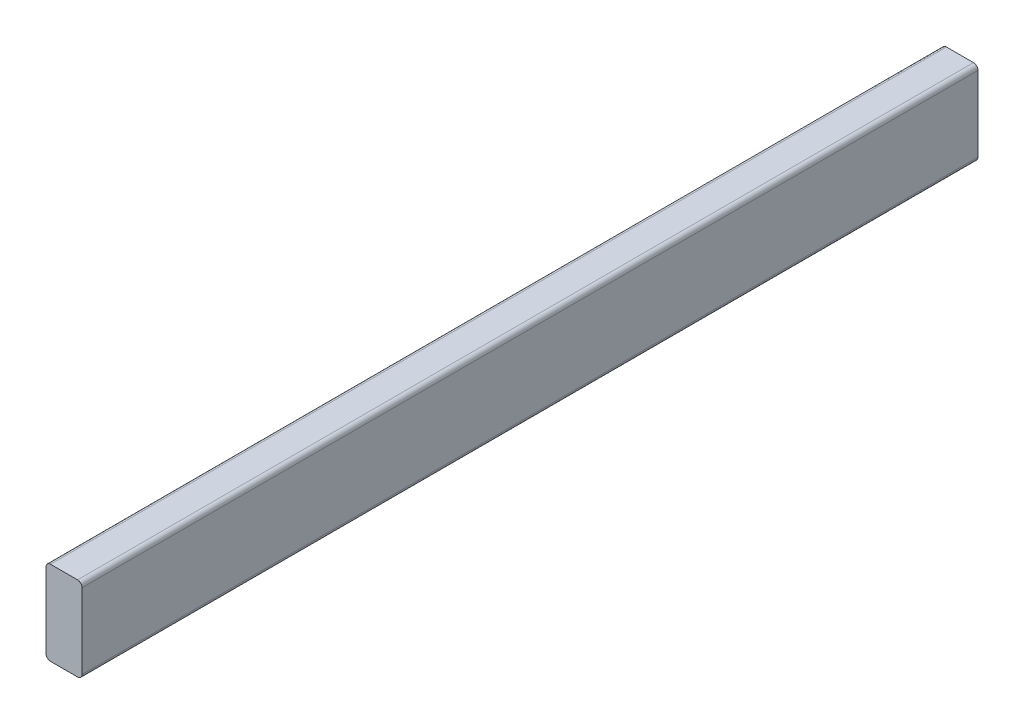
ISO-10303-21;
HEADER;
FILE_DESCRIPTION(('STEP AP214'),'2;1');
FILE_NAME('part.step','',(''),(''),'','','');
FILE_SCHEMA(('AUTOMOTIVE_DESIGN { 1 0 10303 214 1 1 1 1 }'));
ENDSEC;
DATA;
#1=APPLICATION_CONTEXT('core data for automotive mechanical design processes');
#2=APPLICATION_PROTOCOL_DEFINITION('international standard','automotive_design',2000,#1);
#3=PRODUCT_CONTEXT('',#1,'mechanical');
#4=PRODUCT('Part','Part','',(#3));
#5=PRODUCT_RELATED_PRODUCT_CATEGORY('part','',(#4));
#6=PRODUCT_DEFINITION_FORMATION('','',#4);
#7=PRODUCT_DEFINITION_CONTEXT('part definition',#1,'design');
#8=PRODUCT_DEFINITION('design','',#6,#7);
#9=PRODUCT_DEFINITION_SHAPE('','',#8);
#10=(LENGTH_UNIT() NAMED_UNIT(*) SI_UNIT(.MILLI.,.METRE.));
#11=(NAMED_UNIT(*) PLANE_ANGLE_UNIT() SI_UNIT($,.RADIAN.));
#12=(NAMED_UNIT(*) SI_UNIT($,.STERADIAN.) SOLID_ANGLE_UNIT());
#13=UNCERTAINTY_MEASURE_WITH_UNIT(LENGTH_MEASURE(1.E-05),#10,'distance_accuracy_value','');
#14=(GEOMETRIC_REPRESENTATION_CONTEXT(3) GLOBAL_UNCERTAINTY_ASSIGNED_CONTEXT((#13)) GLOBAL_UNIT_ASSIGNED_CONTEXT((#10,
#11,#12)) REPRESENTATION_CONTEXT('',''));
#15=CARTESIAN_POINT('',(0.,0.,0.));
#16=DIRECTION('',(0.,0.,1.));
#17=DIRECTION('',(1.,0.,0.));
#18=AXIS2_PLACEMENT_3D('',#15,#16,#17);
#19=CARTESIAN_POINT('',(0.,0.,0.));
#20=DIRECTION('',(0.,0.,-1.));
#21=DIRECTION('',(-1.,0.,0.));
#22=AXIS2_PLACEMENT_3D('',#19,#20,#21);
#23=PLANE('',#22);
#24=DIRECTION('',(0.,-1.,0.));
#25=VECTOR('',#24,1.);
#26=CARTESIAN_POINT('',(-819.830594651,88.9,0.));
#27=LINE('',#26,#25);
#28=CARTESIAN_POINT('',(-819.830594651,84.1375,0.));
#29=VERTEX_POINT('',#28);
#30=CARTESIAN_POINT('',(-819.830594651,4.7625,0.));
#31=VERTEX_POINT('',#30);
#32=EDGE_CURVE('E112',#29,#31,#27,.T.);
#33=ORIENTED_EDGE('',*,*,#32,.T.);
#34=CARTESIAN_POINT('',(-815.068094651,4.7625,0.));
#35=DIRECTION('',(0.,0.,-1.));
#36=DIRECTION('',(-1.,0.,0.));
#37=AXIS2_PLACEMENT_3D('',#34,#35,#36);
#38=CIRCLE('',#37,4.7625);
#39=CARTESIAN_POINT('',(-815.068094651,0.,0.));
#40=VERTEX_POINT('',#39);
#41=EDGE_CURVE('E189',#31,#40,#38,.F.);
#42=ORIENTED_EDGE('',*,*,#41,.T.);
#43=DIRECTION('',(1.,0.,0.));
#44=VECTOR('',#43,1.);
#45=CARTESIAN_POINT('',(-781.730594651,0.,0.));
#46=LINE('',#45,#44);
#47=CARTESIAN_POINT('',(-786.493094651,0.,0.));
#48=VERTEX_POINT('',#47);
#49=EDGE_CURVE('E117',#40,#48,#46,.T.);
#50=ORIENTED_EDGE('',*,*,#49,.T.);
#51=CARTESIAN_POINT('',(-786.493094651,4.7625,0.));
#52=DIRECTION('',(0.,0.,-1.));
#53=DIRECTION('',(-1.,0.,0.));
#54=AXIS2_PLACEMENT_3D('',#51,#52,#53);
#55=CIRCLE('',#54,4.7625);
#56=CARTESIAN_POINT('',(-781.730594651,4.7625,0.));
#57=VERTEX_POINT('',#56);
#58=EDGE_CURVE('E168',#48,#57,#55,.F.);
#59=ORIENTED_EDGE('',*,*,#58,.T.);
#60=DIRECTION('',(0.,1.,0.));
#61=VECTOR('',#60,1.);
#62=CARTESIAN_POINT('',(-781.730594651,88.9,0.));
#63=LINE('',#62,#61);
#64=CARTESIAN_POINT('',(-781.730594651,84.1375,0.));
#65=VERTEX_POINT('',#64);
#66=EDGE_CURVE('E126',#57,#65,#63,.T.);
#67=ORIENTED_EDGE('',*,*,#66,.T.);
#68=CARTESIAN_POINT('',(-786.493094651,84.1375,0.));
#69=DIRECTION('',(0.,0.,-1.));
#70=DIRECTION('',(-1.,0.,0.));
#71=AXIS2_PLACEMENT_3D('',#68,#69,#70);
#72=CIRCLE('',#71,4.7625);
#73=CARTESIAN_POINT('',(-786.493094651,88.9,0.));
#74=VERTEX_POINT('',#73);
#75=EDGE_CURVE('E163',#65,#74,#72,.F.);
#76=ORIENTED_EDGE('',*,*,#75,.T.);
#77=DIRECTION('',(-1.,0.,0.));
#78=VECTOR('',#77,1.);
#79=CARTESIAN_POINT('',(-781.730594651,88.9,0.));
#80=LINE('',#79,#78);
#81=CARTESIAN_POINT('',(-815.068094651,88.9,0.));
#82=VERTEX_POINT('',#81);
#83=EDGE_CURVE('E157',#74,#82,#80,.T.);
#84=ORIENTED_EDGE('',*,*,#83,.T.);
#85=CARTESIAN_POINT('',(-815.068094651,84.1375,0.));
#86=DIRECTION('',(0.,0.,-1.));
#87=DIRECTION('',(-1.,0.,0.));
#88=AXIS2_PLACEMENT_3D('',#85,#86,#87);
#89=CIRCLE('',#88,4.7625);
#90=EDGE_CURVE('E184',#82,#29,#89,.F.);
#91=ORIENTED_EDGE('',*,*,#90,.T.);
#92=EDGE_LOOP('',(#33,#42,#50,#59,#67,#76,#84,#91));
#93=FACE_BOUND('',#92,.T.);
#94=ADVANCED_FACE('F36',(#93),#23,.F.);
#95=CARTESIAN_POINT('',(-781.730594651,88.9,-1043.37914746776));
#96=DIRECTION('',(0.,1.,0.));
#97=DIRECTION('',(0.,0.,1.));
#98=AXIS2_PLACEMENT_3D('',#95,#96,#97);
#99=PLANE('',#98);
#100=DIRECTION('',(1.,0.,0.));
#101=VECTOR('',#100,1.);
#102=CARTESIAN_POINT('',(0.,88.9,-946.658829023292));
#103=LINE('',#102,#101);
#104=CARTESIAN_POINT('',(-815.068094651,88.9,-946.658829023292));
#105=VERTEX_POINT('',#104);
#106=CARTESIAN_POINT('',(-786.493094651,88.9,-946.658829023292));
#107=VERTEX_POINT('',#106);
#108=EDGE_CURVE('E155',#105,#107,#103,.T.);
#109=ORIENTED_EDGE('',*,*,#108,.F.);
#110=DIRECTION('',(0.,0.,1.));
#111=VECTOR('',#110,1.);
#112=CARTESIAN_POINT('',(-815.068094651,88.9,-1043.37914746776));
#113=LINE('',#112,#111);
#114=EDGE_CURVE('E11',#105,#82,#113,.T.);
#115=ORIENTED_EDGE('',*,*,#114,.T.);
#116=ORIENTED_EDGE('',*,*,#83,.F.);
#117=DIRECTION('',(0.,0.,1.));
#118=VECTOR('',#117,1.);
#119=CARTESIAN_POINT('',(-786.493094651,88.9,-1043.37914746776));
#120=LINE('',#119,#118);
#121=EDGE_CURVE('E45',#74,#107,#120,.F.);
#122=ORIENTED_EDGE('',*,*,#121,.T.);
#123=EDGE_LOOP('',(#109,#115,#116,#122));
#124=FACE_BOUND('',#123,.T.);
#125=ADVANCED_FACE('F154',(#124),#99,.T.);
#126=CARTESIAN_POINT('',(-819.830594651,88.9,-1043.37914746776));
#127=DIRECTION('',(-1.,0.,0.));
#128=DIRECTION('',(0.,0.,1.));
#129=AXIS2_PLACEMENT_3D('',#126,#127,#128);
#130=PLANE('',#129);
#131=DIRECTION('',(0.,-1.,0.));
#132=VECTOR('',#131,1.);
#133=CARTESIAN_POINT('',(-819.830594651,88.9,-946.658829023292));
#134=LINE('',#133,#132);
#135=CARTESIAN_POINT('',(-819.830594651,84.1375,-946.658829023292));
#136=VERTEX_POINT('',#135);
#137=CARTESIAN_POINT('',(-819.830594651,4.7625,-946.658829023292));
#138=VERTEX_POINT('',#137);
#139=EDGE_CURVE('E109',#136,#138,#134,.T.);
#140=ORIENTED_EDGE('',*,*,#139,.T.);
#141=DIRECTION('',(0.,0.,1.));
#142=VECTOR('',#141,1.);
#143=CARTESIAN_POINT('',(-819.830594651,4.7625,-1043.37914746776));
#144=LINE('',#143,#142);
#145=EDGE_CURVE('E116',#138,#31,#144,.T.);
#146=ORIENTED_EDGE('',*,*,#145,.T.);
#147=ORIENTED_EDGE('',*,*,#32,.F.);
#148=DIRECTION('',(0.,0.,1.));
#149=VECTOR('',#148,1.);
#150=CARTESIAN_POINT('',(-819.830594651,84.1375,-1043.37914746776));
#151=LINE('',#150,#149);
#152=EDGE_CURVE('E105',#29,#136,#151,.F.);
#153=ORIENTED_EDGE('',*,*,#152,.T.);
#154=EDGE_LOOP('',(#140,#146,#147,#153));
#155=FACE_BOUND('',#154,.T.);
#156=ADVANCED_FACE('F107',(#155),#130,.T.);
#157=CARTESIAN_POINT('',(-781.730594651,0.,-1043.37914746776));
#158=DIRECTION('',(0.,-1.,0.));
#159=DIRECTION('',(1.,0.,0.));
#160=AXIS2_PLACEMENT_3D('',#157,#158,#159);
#161=PLANE('',#160);
#162=ORIENTED_EDGE('',*,*,#49,.F.);
#163=DIRECTION('',(0.,0.,1.));
#164=VECTOR('',#163,1.);
#165=CARTESIAN_POINT('',(-815.068094651,0.,-1043.37914746776));
#166=LINE('',#165,#164);
#167=CARTESIAN_POINT('',(-815.068094651,0.,-946.658829023292));
#168=VERTEX_POINT('',#167);
#169=EDGE_CURVE('E138',#40,#168,#166,.F.);
#170=ORIENTED_EDGE('',*,*,#169,.T.);
#171=DIRECTION('',(-1.,0.,0.));
#172=VECTOR('',#171,1.);
#173=CARTESIAN_POINT('',(-819.830594651,0.,-946.658829023292));
#174=LINE('',#173,#172);
#175=CARTESIAN_POINT('',(-786.493094651,0.,-946.658829023292));
#176=VERTEX_POINT('',#175);
#177=EDGE_CURVE('E127',#176,#168,#174,.T.);
#178=ORIENTED_EDGE('',*,*,#177,.F.);
#179=DIRECTION('',(0.,0.,1.));
#180=VECTOR('',#179,1.);
#181=CARTESIAN_POINT('',(-786.493094651,0.,-1043.37914746776));
#182=LINE('',#181,#180);
#183=EDGE_CURVE('E192',#176,#48,#182,.T.);
#184=ORIENTED_EDGE('',*,*,#183,.T.);
#185=EDGE_LOOP('',(#162,#170,#178,#184));
#186=FACE_BOUND('',#185,.T.);
#187=ADVANCED_FACE('F201',(#186),#161,.T.);
#188=CARTESIAN_POINT('',(-781.730594651,88.9,-1043.37914746776));
#189=DIRECTION('',(1.,0.,0.));
#190=DIRECTION('',(0.,0.,-1.));
#191=AXIS2_PLACEMENT_3D('',#188,#189,#190);
#192=PLANE('',#191);
#193=ORIENTED_EDGE('',*,*,#66,.F.);
#194=DIRECTION('',(0.,0.,1.));
#195=VECTOR('',#194,1.);
#196=CARTESIAN_POINT('',(-781.730594651,4.7625,-1043.37914746776));
#197=LINE('',#196,#195);
#198=CARTESIAN_POINT('',(-781.730594651,4.7625,-946.658829023292));
#199=VERTEX_POINT('',#198);
#200=EDGE_CURVE('E52',#57,#199,#197,.F.);
#201=ORIENTED_EDGE('',*,*,#200,.T.);
#202=DIRECTION('',(0.,-1.,0.));
#203=VECTOR('',#202,1.);
#204=CARTESIAN_POINT('',(-781.730594651,88.9,-946.658829023292));
#205=LINE('',#204,#203);
#206=CARTESIAN_POINT('',(-781.730594651,84.1375,-946.658829023292));
#207=VERTEX_POINT('',#206);
#208=EDGE_CURVE('E160',#207,#199,#205,.T.);
#209=ORIENTED_EDGE('',*,*,#208,.F.);
#210=DIRECTION('',(0.,0.,1.));
#211=VECTOR('',#210,1.);
#212=CARTESIAN_POINT('',(-781.730594651,84.1375,-1043.37914746776));
#213=LINE('',#212,#211);
#214=EDGE_CURVE('E144',#207,#65,#213,.T.);
#215=ORIENTED_EDGE('',*,*,#214,.T.);
#216=EDGE_LOOP('',(#193,#201,#209,#215));
#217=FACE_BOUND('',#216,.T.);
#218=ADVANCED_FACE('F165',(#217),#192,.T.);
#219=CARTESIAN_POINT('',(-819.830594651,0.,-946.658829023292));
#220=DIRECTION('',(0.,0.,-1.));
#221=DIRECTION('',(-1.,0.,0.));
#222=AXIS2_PLACEMENT_3D('',#219,#220,#221);
#223=PLANE('',#222);
#224=ORIENTED_EDGE('',*,*,#177,.T.);
#225=CARTESIAN_POINT('',(-815.068094651,4.7625,-946.658829023292));
#226=DIRECTION('',(0.,0.,-1.));
#227=DIRECTION('',(-1.,0.,0.));
#228=AXIS2_PLACEMENT_3D('',#225,#226,#227);
#229=CIRCLE('',#228,4.7625);
#230=EDGE_CURVE('E124',#168,#138,#229,.T.);
#231=ORIENTED_EDGE('',*,*,#230,.T.);
#232=ORIENTED_EDGE('',*,*,#139,.F.);
#233=CARTESIAN_POINT('',(-815.068094651,84.1375,-946.658829023292));
#234=DIRECTION('',(0.,0.,-1.));
#235=DIRECTION('',(-1.,0.,0.));
#236=AXIS2_PLACEMENT_3D('',#233,#234,#235);
#237=CIRCLE('',#236,4.7625);
#238=EDGE_CURVE('E121',#136,#105,#237,.T.);
#239=ORIENTED_EDGE('',*,*,#238,.T.);
#240=ORIENTED_EDGE('',*,*,#108,.T.);
#241=CARTESIAN_POINT('',(-786.493094651,84.1375,-946.658829023292));
#242=DIRECTION('',(0.,0.,-1.));
#243=DIRECTION('',(-1.,0.,0.));
#244=AXIS2_PLACEMENT_3D('',#241,#242,#243);
#245=CIRCLE('',#244,4.7625);
#246=EDGE_CURVE('E59',#107,#207,#245,.T.);
#247=ORIENTED_EDGE('',*,*,#246,.T.);
#248=ORIENTED_EDGE('',*,*,#208,.T.);
#249=CARTESIAN_POINT('',(-786.493094651,4.7625,-946.658829023292));
#250=DIRECTION('',(0.,0.,-1.));
#251=DIRECTION('',(-1.,0.,0.));
#252=AXIS2_PLACEMENT_3D('',#249,#250,#251);
#253=CIRCLE('',#252,4.7625);
#254=EDGE_CURVE('E132',#199,#176,#253,.T.);
#255=ORIENTED_EDGE('',*,*,#254,.T.);
#256=EDGE_LOOP('',(#224,#231,#232,#239,#240,#247,#248,#255));
#257=FACE_BOUND('',#256,.T.);
#258=ADVANCED_FACE('F120',(#257),#223,.T.);
#259=CARTESIAN_POINT('',(-815.068094651,4.7625,-1043.37914746776));
#260=DIRECTION('',(0.,0.,1.));
#261=DIRECTION('',(1.,0.,0.));
#262=AXIS2_PLACEMENT_3D('',#259,#260,#261);
#263=CYLINDRICAL_SURFACE('',#262,4.7625);
#264=ORIENTED_EDGE('',*,*,#230,.F.);
#265=ORIENTED_EDGE('',*,*,#169,.F.);
#266=ORIENTED_EDGE('',*,*,#41,.F.);
#267=ORIENTED_EDGE('',*,*,#145,.F.);
#268=EDGE_LOOP('',(#264,#265,#266,#267));
#269=FACE_BOUND('',#268,.T.);
#270=ADVANCED_FACE('F206',(#269),#263,.T.);
#271=CARTESIAN_POINT('',(-786.493094651,4.7625,-1043.37914746776));
#272=DIRECTION('',(0.,0.,1.));
#273=DIRECTION('',(1.,0.,0.));
#274=AXIS2_PLACEMENT_3D('',#271,#272,#273);
#275=CYLINDRICAL_SURFACE('',#274,4.7625);
#276=ORIENTED_EDGE('',*,*,#254,.F.);
#277=ORIENTED_EDGE('',*,*,#200,.F.);
#278=ORIENTED_EDGE('',*,*,#58,.F.);
#279=ORIENTED_EDGE('',*,*,#183,.F.);
#280=EDGE_LOOP('',(#276,#277,#278,#279));
#281=FACE_BOUND('',#280,.T.);
#282=ADVANCED_FACE('F208',(#281),#275,.T.);
#283=CARTESIAN_POINT('',(-815.068094651,84.1375,-1043.37914746776));
#284=DIRECTION('',(0.,0.,1.));
#285=DIRECTION('',(1.,0.,0.));
#286=AXIS2_PLACEMENT_3D('',#283,#284,#285);
#287=CYLINDRICAL_SURFACE('',#286,4.7625);
#288=ORIENTED_EDGE('',*,*,#238,.F.);
#289=ORIENTED_EDGE('',*,*,#152,.F.);
#290=ORIENTED_EDGE('',*,*,#90,.F.);
#291=ORIENTED_EDGE('',*,*,#114,.F.);
#292=EDGE_LOOP('',(#288,#289,#290,#291));
#293=FACE_BOUND('',#292,.T.);
#294=ADVANCED_FACE('F130',(#293),#287,.T.);
#295=CARTESIAN_POINT('',(-786.493094651,84.1375,-1043.37914746776));
#296=DIRECTION('',(0.,0.,1.));
#297=DIRECTION('',(1.,0.,0.));
#298=AXIS2_PLACEMENT_3D('',#295,#296,#297);
#299=CYLINDRICAL_SURFACE('',#298,4.7625);
#300=ORIENTED_EDGE('',*,*,#246,.F.);
#301=ORIENTED_EDGE('',*,*,#121,.F.);
#302=ORIENTED_EDGE('',*,*,#75,.F.);
#303=ORIENTED_EDGE('',*,*,#214,.F.);
#304=EDGE_LOOP('',(#300,#301,#302,#303));
#305=FACE_BOUND('',#304,.T.);
#306=ADVANCED_FACE('F38',(#305),#299,.T.);
#307=CLOSED_SHELL('',(#94,#125,#156,#187,#218,#258,#270,#282,#294,#306));
#308=MANIFOLD_SOLID_BREP('B2',#307);
#309=ADVANCED_BREP_SHAPE_REPRESENTATION('',(#18,#308),#14);
#310=SHAPE_DEFINITION_REPRESENTATION(#9,#309);
ENDSEC;
END-ISO-10303-21;
